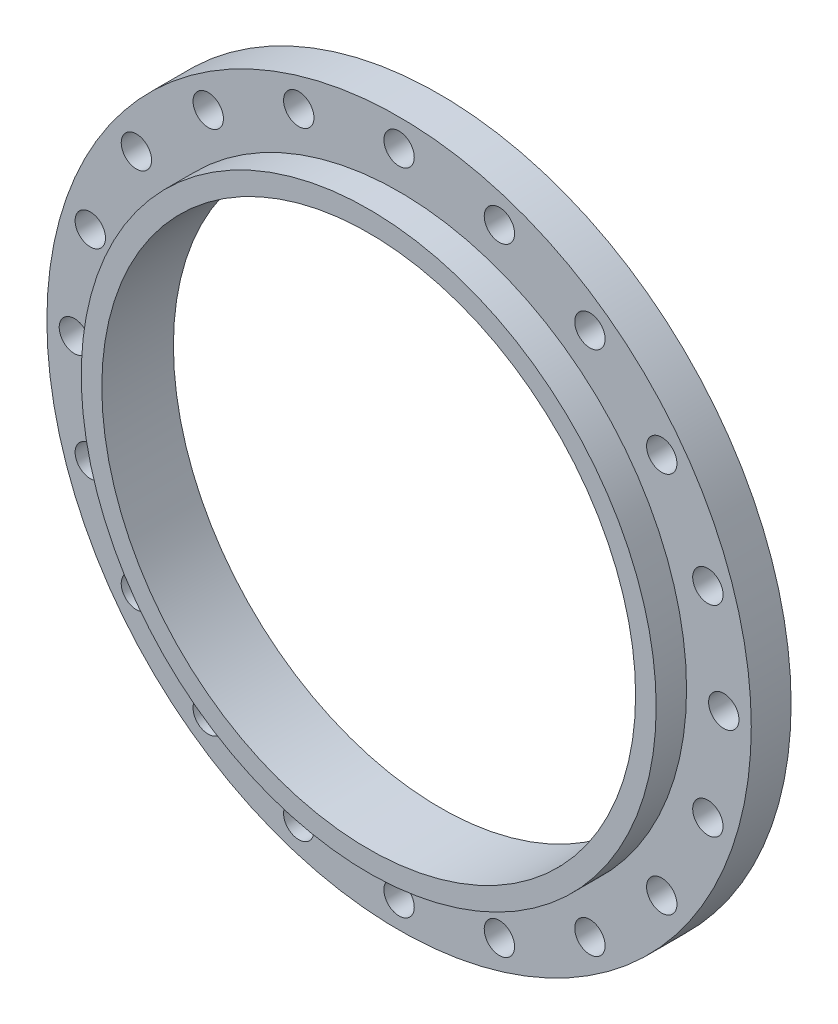
ISO-10303-21;
HEADER;
FILE_DESCRIPTION(('STEP AP214'),'2;1');
FILE_NAME('part.step','',(''),(''),'','','');
FILE_SCHEMA(('AUTOMOTIVE_DESIGN { 1 0 10303 214 1 1 1 1 }'));
ENDSEC;
DATA;
#1=APPLICATION_CONTEXT('core data for automotive mechanical design processes');
#2=APPLICATION_PROTOCOL_DEFINITION('international standard','automotive_design',2000,#1);
#3=PRODUCT_CONTEXT('',#1,'mechanical');
#4=PRODUCT('Part','Part','',(#3));
#5=PRODUCT_RELATED_PRODUCT_CATEGORY('part','',(#4));
#6=PRODUCT_DEFINITION_FORMATION('','',#4);
#7=PRODUCT_DEFINITION_CONTEXT('part definition',#1,'design');
#8=PRODUCT_DEFINITION('design','',#6,#7);
#9=PRODUCT_DEFINITION_SHAPE('','',#8);
#10=(LENGTH_UNIT() NAMED_UNIT(*) SI_UNIT(.MILLI.,.METRE.));
#11=(NAMED_UNIT(*) PLANE_ANGLE_UNIT() SI_UNIT($,.RADIAN.));
#12=(NAMED_UNIT(*) SI_UNIT($,.STERADIAN.) SOLID_ANGLE_UNIT());
#13=UNCERTAINTY_MEASURE_WITH_UNIT(LENGTH_MEASURE(1.E-05),#10,'distance_accuracy_value','');
#14=(GEOMETRIC_REPRESENTATION_CONTEXT(3) GLOBAL_UNCERTAINTY_ASSIGNED_CONTEXT((#13)) GLOBAL_UNIT_ASSIGNED_CONTEXT((#10,
#11,#12)) REPRESENTATION_CONTEXT('',''));
#15=CARTESIAN_POINT('',(0.,0.,0.));
#16=DIRECTION('',(0.,0.,1.));
#17=DIRECTION('',(1.,0.,0.));
#18=AXIS2_PLACEMENT_3D('',#15,#16,#17);
#19=CARTESIAN_POINT('',(0.,0.,18.2645913337541));
#20=DIRECTION('',(0.,0.,-1.));
#21=DIRECTION('',(-1.,0.,0.));
#22=AXIS2_PLACEMENT_3D('',#19,#20,#21);
#23=CYLINDRICAL_SURFACE('',#22,406.4);
#24=CARTESIAN_POINT('',(0.,0.,18.2645913337541));
#25=DIRECTION('',(0.,0.,1.));
#26=DIRECTION('',(1.,0.,0.));
#27=AXIS2_PLACEMENT_3D('',#24,#25,#26);
#28=CIRCLE('',#27,406.4);
#29=CARTESIAN_POINT('',(406.4,0.,18.2645913337541));
#30=VERTEX_POINT('',#29);
#31=EDGE_CURVE('E10',#30,#30,#28,.T.);
#32=ORIENTED_EDGE('',*,*,#31,.F.);
#33=EDGE_LOOP('',(#32));
#34=FACE_BOUND('',#33,.T.);
#35=CARTESIAN_POINT('',(0.,0.,-27.7094086662459));
#36=DIRECTION('',(0.,0.,1.));
#37=DIRECTION('',(1.,0.,0.));
#38=AXIS2_PLACEMENT_3D('',#35,#36,#37);
#39=CIRCLE('',#38,406.4);
#40=CARTESIAN_POINT('',(406.4,0.,-27.7094086662459));
#41=VERTEX_POINT('',#40);
#42=EDGE_CURVE('E41',#41,#41,#39,.T.);
#43=ORIENTED_EDGE('',*,*,#42,.T.);
#44=EDGE_LOOP('',(#43));
#45=FACE_BOUND('',#44,.T.);
#46=ADVANCED_FACE('F34',(#34,#45),#23,.T.);
#47=CARTESIAN_POINT('',(0.,0.,18.2645913337541));
#48=DIRECTION('',(0.,0.,1.));
#49=DIRECTION('',(1.,0.,0.));
#50=AXIS2_PLACEMENT_3D('',#47,#48,#49);
#51=PLANE('',#50);
#52=CARTESIAN_POINT('',(-220.213744771376,303.098216942574,18.2645913337541));
#53=DIRECTION('',(0.,0.,1.));
#54=DIRECTION('',(1.,0.,0.));
#55=AXIS2_PLACEMENT_3D('',#52,#53,#54);
#56=CIRCLE('',#55,17.526);
#57=CARTESIAN_POINT('',(-202.687744771376,303.098216942574,18.2645913337541));
#58=VERTEX_POINT('',#57);
#59=EDGE_CURVE('E68',#58,#58,#56,.F.);
#60=ORIENTED_EDGE('',*,*,#59,.T.);
#61=EDGE_LOOP('',(#60));
#62=FACE_BOUND('',#61,.T.);
#63=CARTESIAN_POINT('',(-303.098216942574,220.213744771374,18.2645913337541));
#64=DIRECTION('',(0.,0.,1.));
#65=DIRECTION('',(1.,0.,0.));
#66=AXIS2_PLACEMENT_3D('',#63,#64,#65);
#67=CIRCLE('',#66,17.526);
#68=CARTESIAN_POINT('',(-285.572216942575,220.213744771374,18.2645913337541));
#69=VERTEX_POINT('',#68);
#70=EDGE_CURVE('E71',#69,#69,#67,.F.);
#71=ORIENTED_EDGE('',*,*,#70,.T.);
#72=EDGE_LOOP('',(#71));
#73=FACE_BOUND('',#72,.T.);
#74=CARTESIAN_POINT('',(-356.31332382998,115.773216942573,18.2645913337541));
#75=DIRECTION('',(0.,0.,1.));
#76=DIRECTION('',(1.,0.,0.));
#77=AXIS2_PLACEMENT_3D('',#74,#75,#76);
#78=CIRCLE('',#77,17.526);
#79=CARTESIAN_POINT('',(-338.78732382998,115.773216942573,18.2645913337541));
#80=VERTEX_POINT('',#79);
#81=EDGE_CURVE('E74',#80,#80,#78,.F.);
#82=ORIENTED_EDGE('',*,*,#81,.T.);
#83=EDGE_LOOP('',(#82));
#84=FACE_BOUND('',#83,.T.);
#85=CARTESIAN_POINT('',(-374.65,-1.24643495181374E-12,18.2645913337541));
#86=DIRECTION('',(0.,0.,1.));
#87=DIRECTION('',(1.,0.,0.));
#88=AXIS2_PLACEMENT_3D('',#85,#86,#87);
#89=CIRCLE('',#88,17.526);
#90=CARTESIAN_POINT('',(-357.124,-1.24643495181374E-12,18.2645913337541));
#91=VERTEX_POINT('',#90);
#92=EDGE_CURVE('E77',#91,#91,#89,.F.);
#93=ORIENTED_EDGE('',*,*,#92,.T.);
#94=EDGE_LOOP('',(#93));
#95=FACE_BOUND('',#94,.T.);
#96=CARTESIAN_POINT('',(-356.313323829979,-115.773216942576,18.2645913337541));
#97=DIRECTION('',(0.,0.,1.));
#98=DIRECTION('',(1.,0.,0.));
#99=AXIS2_PLACEMENT_3D('',#96,#97,#98);
#100=CIRCLE('',#99,17.526);
#101=CARTESIAN_POINT('',(-338.787323829979,-115.773216942576,18.2645913337541));
#102=VERTEX_POINT('',#101);
#103=EDGE_CURVE('E80',#102,#102,#100,.F.);
#104=ORIENTED_EDGE('',*,*,#103,.T.);
#105=EDGE_LOOP('',(#104));
#106=FACE_BOUND('',#105,.T.);
#107=CARTESIAN_POINT('',(-303.098216942573,-220.213744771376,18.2645913337541));
#108=DIRECTION('',(0.,0.,1.));
#109=DIRECTION('',(1.,0.,0.));
#110=AXIS2_PLACEMENT_3D('',#107,#108,#109);
#111=CIRCLE('',#110,17.526);
#112=CARTESIAN_POINT('',(-285.572216942573,-220.213744771376,18.2645913337541));
#113=VERTEX_POINT('',#112);
#114=EDGE_CURVE('E83',#113,#113,#111,.F.);
#115=ORIENTED_EDGE('',*,*,#114,.T.);
#116=EDGE_LOOP('',(#115));
#117=FACE_BOUND('',#116,.T.);
#118=CARTESIAN_POINT('',(-220.213744771373,-303.098216942575,18.2645913337541));
#119=DIRECTION('',(0.,0.,1.));
#120=DIRECTION('',(1.,0.,0.));
#121=AXIS2_PLACEMENT_3D('',#118,#119,#120);
#122=CIRCLE('',#121,17.526);
#123=CARTESIAN_POINT('',(-202.687744771373,-303.098216942575,18.2645913337541));
#124=VERTEX_POINT('',#123);
#125=EDGE_CURVE('E86',#124,#124,#122,.F.);
#126=ORIENTED_EDGE('',*,*,#125,.T.);
#127=EDGE_LOOP('',(#126));
#128=FACE_BOUND('',#127,.T.);
#129=CARTESIAN_POINT('',(-115.773216942572,-356.31332382998,18.2645913337541));
#130=DIRECTION('',(0.,0.,1.));
#131=DIRECTION('',(1.,0.,0.));
#132=AXIS2_PLACEMENT_3D('',#129,#130,#131);
#133=CIRCLE('',#132,17.526);
#134=CARTESIAN_POINT('',(-98.2472169425717,-356.31332382998,18.2645913337541));
#135=VERTEX_POINT('',#134);
#136=EDGE_CURVE('E89',#135,#135,#133,.F.);
#137=ORIENTED_EDGE('',*,*,#136,.T.);
#138=EDGE_LOOP('',(#137));
#139=FACE_BOUND('',#138,.T.);
#140=CARTESIAN_POINT('',(0.,-374.65,18.2645913337541));
#141=DIRECTION('',(0.,0.,1.));
#142=DIRECTION('',(1.,0.,0.));
#143=AXIS2_PLACEMENT_3D('',#140,#141,#142);
#144=CIRCLE('',#143,17.526);
#145=CARTESIAN_POINT('',(17.526,-374.65,18.2645913337541));
#146=VERTEX_POINT('',#145);
#147=EDGE_CURVE('E92',#146,#146,#144,.F.);
#148=ORIENTED_EDGE('',*,*,#147,.T.);
#149=EDGE_LOOP('',(#148));
#150=FACE_BOUND('',#149,.T.);
#151=CARTESIAN_POINT('',(115.773216942577,-356.313323829978,18.2645913337541));
#152=DIRECTION('',(0.,0.,1.));
#153=DIRECTION('',(1.,0.,0.));
#154=AXIS2_PLACEMENT_3D('',#151,#152,#153);
#155=CIRCLE('',#154,17.526);
#156=CARTESIAN_POINT('',(133.299216942577,-356.313323829978,18.2645913337541));
#157=VERTEX_POINT('',#156);
#158=EDGE_CURVE('E95',#157,#157,#155,.F.);
#159=ORIENTED_EDGE('',*,*,#158,.T.);
#160=EDGE_LOOP('',(#159));
#161=FACE_BOUND('',#160,.T.);
#162=CARTESIAN_POINT('',(220.213744771378,-303.098216942572,18.2645913337541));
#163=DIRECTION('',(0.,0.,1.));
#164=DIRECTION('',(1.,0.,0.));
#165=AXIS2_PLACEMENT_3D('',#162,#163,#164);
#166=CIRCLE('',#165,17.526);
#167=CARTESIAN_POINT('',(237.739744771378,-303.098216942572,18.2645913337541));
#168=VERTEX_POINT('',#167);
#169=EDGE_CURVE('E98',#168,#168,#166,.F.);
#170=ORIENTED_EDGE('',*,*,#169,.T.);
#171=EDGE_LOOP('',(#170));
#172=FACE_BOUND('',#171,.T.);
#173=CARTESIAN_POINT('',(303.098216942576,-220.213744771372,18.2645913337541));
#174=DIRECTION('',(0.,0.,1.));
#175=DIRECTION('',(1.,0.,0.));
#176=AXIS2_PLACEMENT_3D('',#173,#174,#175);
#177=CIRCLE('',#176,17.526);
#178=CARTESIAN_POINT('',(320.624216942576,-220.213744771372,18.2645913337541));
#179=VERTEX_POINT('',#178);
#180=EDGE_CURVE('E101',#179,#179,#177,.F.);
#181=ORIENTED_EDGE('',*,*,#180,.T.);
#182=EDGE_LOOP('',(#181));
#183=FACE_BOUND('',#182,.T.);
#184=CARTESIAN_POINT('',(356.31332382998,-115.773216942571,18.2645913337541));
#185=DIRECTION('',(0.,0.,1.));
#186=DIRECTION('',(1.,0.,0.));
#187=AXIS2_PLACEMENT_3D('',#184,#185,#186);
#188=CIRCLE('',#187,17.526);
#189=CARTESIAN_POINT('',(373.83932382998,-115.773216942571,18.2645913337541));
#190=VERTEX_POINT('',#189);
#191=EDGE_CURVE('E104',#190,#190,#188,.F.);
#192=ORIENTED_EDGE('',*,*,#191,.T.);
#193=EDGE_LOOP('',(#192));
#194=FACE_BOUND('',#193,.T.);
#195=CARTESIAN_POINT('',(374.65,3.98589898257658E-12,18.2645913337541));
#196=DIRECTION('',(0.,0.,1.));
#197=DIRECTION('',(1.,0.,0.));
#198=AXIS2_PLACEMENT_3D('',#195,#196,#197);
#199=CIRCLE('',#198,17.526);
#200=CARTESIAN_POINT('',(392.176,3.98589898257658E-12,18.2645913337541));
#201=VERTEX_POINT('',#200);
#202=EDGE_CURVE('E107',#201,#201,#199,.F.);
#203=ORIENTED_EDGE('',*,*,#202,.T.);
#204=EDGE_LOOP('',(#203));
#205=FACE_BOUND('',#204,.T.);
#206=CARTESIAN_POINT('',(356.313323829978,115.773216942578,18.2645913337541));
#207=DIRECTION('',(0.,0.,1.));
#208=DIRECTION('',(1.,0.,0.));
#209=AXIS2_PLACEMENT_3D('',#206,#207,#208);
#210=CIRCLE('',#209,17.526);
#211=CARTESIAN_POINT('',(373.839323829978,115.773216942578,18.2645913337541));
#212=VERTEX_POINT('',#211);
#213=EDGE_CURVE('E110',#212,#212,#210,.F.);
#214=ORIENTED_EDGE('',*,*,#213,.T.);
#215=EDGE_LOOP('',(#214));
#216=FACE_BOUND('',#215,.T.);
#217=CARTESIAN_POINT('',(303.098216942571,220.213744771379,18.2645913337541));
#218=DIRECTION('',(0.,0.,1.));
#219=DIRECTION('',(1.,0.,0.));
#220=AXIS2_PLACEMENT_3D('',#217,#218,#219);
#221=CIRCLE('',#220,17.526);
#222=CARTESIAN_POINT('',(320.624216942571,220.213744771379,18.2645913337541));
#223=VERTEX_POINT('',#222);
#224=EDGE_CURVE('E113',#223,#223,#221,.F.);
#225=ORIENTED_EDGE('',*,*,#224,.T.);
#226=EDGE_LOOP('',(#225));
#227=FACE_BOUND('',#226,.T.);
#228=CARTESIAN_POINT('',(220.213744771371,303.098216942577,18.2645913337541));
#229=DIRECTION('',(0.,0.,1.));
#230=DIRECTION('',(1.,0.,0.));
#231=AXIS2_PLACEMENT_3D('',#228,#229,#230);
#232=CIRCLE('',#231,17.526);
#233=CARTESIAN_POINT('',(237.739744771371,303.098216942577,18.2645913337541));
#234=VERTEX_POINT('',#233);
#235=EDGE_CURVE('E116',#234,#234,#232,.F.);
#236=ORIENTED_EDGE('',*,*,#235,.T.);
#237=EDGE_LOOP('',(#236));
#238=FACE_BOUND('',#237,.T.);
#239=CARTESIAN_POINT('',(115.773216942569,356.313323829981,18.2645913337541));
#240=DIRECTION('',(0.,0.,1.));
#241=DIRECTION('',(1.,0.,0.));
#242=AXIS2_PLACEMENT_3D('',#239,#240,#241);
#243=CIRCLE('',#242,17.526);
#244=CARTESIAN_POINT('',(133.299216942569,356.313323829981,18.2645913337541));
#245=VERTEX_POINT('',#244);
#246=EDGE_CURVE('E119',#245,#245,#243,.F.);
#247=ORIENTED_EDGE('',*,*,#246,.T.);
#248=EDGE_LOOP('',(#247));
#249=FACE_BOUND('',#248,.T.);
#250=CARTESIAN_POINT('',(-115.773216942574,356.313323829979,18.2645913337541));
#251=DIRECTION('',(0.,0.,1.));
#252=DIRECTION('',(1.,0.,0.));
#253=AXIS2_PLACEMENT_3D('',#250,#251,#252);
#254=CIRCLE('',#253,17.526);
#255=CARTESIAN_POINT('',(-98.2472169425744,356.313323829979,18.2645913337541));
#256=VERTEX_POINT('',#255);
#257=EDGE_CURVE('E122',#256,#256,#254,.F.);
#258=ORIENTED_EDGE('',*,*,#257,.T.);
#259=EDGE_LOOP('',(#258));
#260=FACE_BOUND('',#259,.T.);
#261=CARTESIAN_POINT('',(0.,374.65,18.2645913337541));
#262=DIRECTION('',(0.,0.,1.));
#263=DIRECTION('',(1.,0.,0.));
#264=AXIS2_PLACEMENT_3D('',#261,#262,#263);
#265=CIRCLE('',#264,17.526);
#266=CARTESIAN_POINT('',(17.526,374.65,18.2645913337541));
#267=VERTEX_POINT('',#266);
#268=EDGE_CURVE('E62',#267,#267,#265,.F.);
#269=ORIENTED_EDGE('',*,*,#268,.T.);
#270=EDGE_LOOP('',(#269));
#271=FACE_BOUND('',#270,.T.);
#272=CARTESIAN_POINT('',(0.,0.,18.2645913337541));
#273=DIRECTION('',(0.,0.,1.));
#274=DIRECTION('',(1.,0.,0.));
#275=AXIS2_PLACEMENT_3D('',#272,#273,#274);
#276=CIRCLE('',#275,331.724);
#277=CARTESIAN_POINT('',(331.724,0.,18.2645913337541));
#278=VERTEX_POINT('',#277);
#279=EDGE_CURVE('E46',#278,#278,#276,.F.);
#280=ORIENTED_EDGE('',*,*,#279,.T.);
#281=EDGE_LOOP('',(#280));
#282=FACE_BOUND('',#281,.T.);
#283=ORIENTED_EDGE('',*,*,#31,.T.);
#284=EDGE_LOOP('',(#283));
#285=FACE_BOUND('',#284,.T.);
#286=ADVANCED_FACE('F204',(#62,#73,#84,#95,#106,#117,#128,#139,#150,#161,#172,#183,#194,#205,
#216,#227,#238,#249,#260,#271,#282,#285),#51,.T.);
#287=CARTESIAN_POINT('',(0.,0.,-27.7094086662459));
#288=DIRECTION('',(0.,0.,1.));
#289=DIRECTION('',(1.,0.,0.));
#290=AXIS2_PLACEMENT_3D('',#287,#288,#289);
#291=PLANE('',#290);
#292=CARTESIAN_POINT('',(-220.213744771376,303.098216942574,-27.7094086662459));
#293=DIRECTION('',(0.,0.,1.));
#294=DIRECTION('',(0.809016994374947,0.587785252292474,0.));
#295=AXIS2_PLACEMENT_3D('',#292,#293,#294);
#296=CIRCLE('',#295,17.526);
#297=CARTESIAN_POINT('',(-206.03491292796,313.399741274252,-27.7094086662459));
#298=VERTEX_POINT('',#297);
#299=EDGE_CURVE('E128',#298,#298,#296,.T.);
#300=ORIENTED_EDGE('',*,*,#299,.T.);
#301=EDGE_LOOP('',(#300));
#302=FACE_BOUND('',#301,.T.);
#303=CARTESIAN_POINT('',(-303.098216942574,220.213744771374,-27.7094086662459));
#304=DIRECTION('',(0.,0.,1.));
#305=DIRECTION('',(0.587785252292471,0.809016994374949,0.));
#306=AXIS2_PLACEMENT_3D('',#303,#304,#305);
#307=CIRCLE('',#306,17.526);
#308=CARTESIAN_POINT('',(-292.796692610897,234.39257661479,-27.7094086662459));
#309=VERTEX_POINT('',#308);
#310=EDGE_CURVE('E172',#309,#309,#307,.T.);
#311=ORIENTED_EDGE('',*,*,#310,.T.);
#312=EDGE_LOOP('',(#311));
#313=FACE_BOUND('',#312,.T.);
#314=CARTESIAN_POINT('',(-356.31332382998,115.773216942573,-27.7094086662459));
#315=DIRECTION('',(0.,0.,1.));
#316=DIRECTION('',(0.309016994374945,0.951056516295155,0.));
#317=AXIS2_PLACEMENT_3D('',#314,#315,#316);
#318=CIRCLE('',#317,17.526);
#319=CARTESIAN_POINT('',(-350.897491986564,132.441433447162,-27.7094086662459));
#320=VERTEX_POINT('',#319);
#321=EDGE_CURVE('E169',#320,#320,#318,.T.);
#322=ORIENTED_EDGE('',*,*,#321,.T.);
#323=EDGE_LOOP('',(#322));
#324=FACE_BOUND('',#323,.T.);
#325=CARTESIAN_POINT('',(-374.65,-1.24643495181374E-12,-27.7094086662459));
#326=DIRECTION('',(0.,0.,1.));
#327=DIRECTION('',(0.,1.,0.));
#328=AXIS2_PLACEMENT_3D('',#325,#326,#327);
#329=CIRCLE('',#328,17.526);
#330=CARTESIAN_POINT('',(-374.65,17.5259999999987,-27.7094086662459));
#331=VERTEX_POINT('',#330);
#332=EDGE_CURVE('E166',#331,#331,#329,.T.);
#333=ORIENTED_EDGE('',*,*,#332,.T.);
#334=EDGE_LOOP('',(#333));
#335=FACE_BOUND('',#334,.T.);
#336=CARTESIAN_POINT('',(-356.313323829979,-115.773216942576,-27.7094086662459));
#337=DIRECTION('',(0.,0.,1.));
#338=DIRECTION('',(-0.309016994374952,0.951056516295152,0.));
#339=AXIS2_PLACEMENT_3D('',#336,#337,#338);
#340=CIRCLE('',#339,17.526);
#341=CARTESIAN_POINT('',(-361.729155673394,-99.1050004379867,-27.7094086662459));
#342=VERTEX_POINT('',#341);
#343=EDGE_CURVE('E163',#342,#342,#340,.T.);
#344=ORIENTED_EDGE('',*,*,#343,.T.);
#345=EDGE_LOOP('',(#344));
#346=FACE_BOUND('',#345,.T.);
#347=CARTESIAN_POINT('',(-303.098216942573,-220.213744771376,-27.7094086662459));
#348=DIRECTION('',(0.,0.,1.));
#349=DIRECTION('',(-0.587785252292477,0.809016994374945,0.));
#350=AXIS2_PLACEMENT_3D('',#347,#348,#349);
#351=CIRCLE('',#350,17.526);
#352=CARTESIAN_POINT('',(-313.399741274251,-206.034912927961,-27.7094086662459));
#353=VERTEX_POINT('',#352);
#354=EDGE_CURVE('E160',#353,#353,#351,.T.);
#355=ORIENTED_EDGE('',*,*,#354,.T.);
#356=EDGE_LOOP('',(#355));
#357=FACE_BOUND('',#356,.T.);
#358=CARTESIAN_POINT('',(-220.213744771373,-303.098216942575,-27.7094086662459));
#359=DIRECTION('',(0.,0.,1.));
#360=DIRECTION('',(-0.809016994374951,0.587785252292469,0.));
#361=AXIS2_PLACEMENT_3D('',#358,#359,#360);
#362=CIRCLE('',#361,17.526);
#363=CARTESIAN_POINT('',(-234.392576614789,-292.796692610897,-27.7094086662459));
#364=VERTEX_POINT('',#363);
#365=EDGE_CURVE('E157',#364,#364,#362,.T.);
#366=ORIENTED_EDGE('',*,*,#365,.T.);
#367=EDGE_LOOP('',(#366));
#368=FACE_BOUND('',#367,.T.);
#369=CARTESIAN_POINT('',(-115.773216942572,-356.31332382998,-27.7094086662459));
#370=DIRECTION('',(0.,0.,1.));
#371=DIRECTION('',(-0.951056516295156,0.309016994374941,0.));
#372=AXIS2_PLACEMENT_3D('',#369,#370,#371);
#373=CIRCLE('',#372,17.526);
#374=CARTESIAN_POINT('',(-132.441433447161,-350.897491986565,-27.7094086662459));
#375=VERTEX_POINT('',#374);
#376=EDGE_CURVE('E154',#375,#375,#373,.T.);
#377=ORIENTED_EDGE('',*,*,#376,.T.);
#378=EDGE_LOOP('',(#377));
#379=FACE_BOUND('',#378,.T.);
#380=CARTESIAN_POINT('',(0.,-374.65,-27.7094086662459));
#381=DIRECTION('',(0.,0.,1.));
#382=DIRECTION('',(-1.,0.,0.));
#383=AXIS2_PLACEMENT_3D('',#380,#381,#382);
#384=CIRCLE('',#383,17.526);
#385=CARTESIAN_POINT('',(-17.526,-374.65,-27.7094086662459));
#386=VERTEX_POINT('',#385);
#387=EDGE_CURVE('E151',#386,#386,#384,.T.);
#388=ORIENTED_EDGE('',*,*,#387,.T.);
#389=EDGE_LOOP('',(#388));
#390=FACE_BOUND('',#389,.T.);
#391=CARTESIAN_POINT('',(115.773216942577,-356.313323829978,-27.7094086662459));
#392=DIRECTION('',(0.,0.,1.));
#393=DIRECTION('',(-0.951056516295151,-0.309016994374955,0.));
#394=AXIS2_PLACEMENT_3D('',#391,#392,#393);
#395=CIRCLE('',#394,17.526);
#396=CARTESIAN_POINT('',(99.105000437988,-361.729155673394,-27.7094086662459));
#397=VERTEX_POINT('',#396);
#398=EDGE_CURVE('E148',#397,#397,#395,.T.);
#399=ORIENTED_EDGE('',*,*,#398,.T.);
#400=EDGE_LOOP('',(#399));
#401=FACE_BOUND('',#400,.T.);
#402=CARTESIAN_POINT('',(220.213744771378,-303.098216942572,-27.7094086662459));
#403=DIRECTION('',(0.,0.,1.));
#404=DIRECTION('',(-0.809016994374942,-0.58778525229248,0.));
#405=AXIS2_PLACEMENT_3D('',#402,#403,#404);
#406=CIRCLE('',#405,17.526);
#407=CARTESIAN_POINT('',(206.034912927962,-313.39974127425,-27.7094086662459));
#408=VERTEX_POINT('',#407);
#409=EDGE_CURVE('E145',#408,#408,#406,.T.);
#410=ORIENTED_EDGE('',*,*,#409,.T.);
#411=EDGE_LOOP('',(#410));
#412=FACE_BOUND('',#411,.T.);
#413=CARTESIAN_POINT('',(303.098216942576,-220.213744771372,-27.7094086662459));
#414=DIRECTION('',(0.,0.,1.));
#415=DIRECTION('',(-0.587785252292465,-0.809016994374953,0.));
#416=AXIS2_PLACEMENT_3D('',#413,#414,#415);
#417=CIRCLE('',#416,17.526);
#418=CARTESIAN_POINT('',(292.796692610898,-234.392576614787,-27.7094086662459));
#419=VERTEX_POINT('',#418);
#420=EDGE_CURVE('E142',#419,#419,#417,.T.);
#421=ORIENTED_EDGE('',*,*,#420,.T.);
#422=EDGE_LOOP('',(#421));
#423=FACE_BOUND('',#422,.T.);
#424=CARTESIAN_POINT('',(356.31332382998,-115.773216942571,-27.7094086662459));
#425=DIRECTION('',(0.,0.,1.));
#426=DIRECTION('',(-0.309016994374938,-0.951056516295157,0.));
#427=AXIS2_PLACEMENT_3D('',#424,#425,#426);
#428=CIRCLE('',#427,17.526);
#429=CARTESIAN_POINT('',(350.897491986565,-132.441433447159,-27.7094086662459));
#430=VERTEX_POINT('',#429);
#431=EDGE_CURVE('E139',#430,#430,#428,.T.);
#432=ORIENTED_EDGE('',*,*,#431,.T.);
#433=EDGE_LOOP('',(#432));
#434=FACE_BOUND('',#433,.T.);
#435=CARTESIAN_POINT('',(374.65,3.98589898257658E-12,-27.7094086662459));
#436=DIRECTION('',(0.,0.,1.));
#437=DIRECTION('',(0.,-1.,0.));
#438=AXIS2_PLACEMENT_3D('',#435,#436,#437);
#439=CIRCLE('',#438,17.526);
#440=CARTESIAN_POINT('',(374.65,-17.525999999996,-27.7094086662459));
#441=VERTEX_POINT('',#440);
#442=EDGE_CURVE('E136',#441,#441,#439,.T.);
#443=ORIENTED_EDGE('',*,*,#442,.T.);
#444=EDGE_LOOP('',(#443));
#445=FACE_BOUND('',#444,.T.);
#446=CARTESIAN_POINT('',(356.313323829978,115.773216942578,-27.7094086662459));
#447=DIRECTION('',(0.,0.,1.));
#448=DIRECTION('',(0.309016994374958,-0.95105651629515,0.));
#449=AXIS2_PLACEMENT_3D('',#446,#447,#448);
#450=CIRCLE('',#449,17.526);
#451=CARTESIAN_POINT('',(361.729155673393,99.1050004379894,-27.7094086662459));
#452=VERTEX_POINT('',#451);
#453=EDGE_CURVE('E132',#452,#452,#450,.T.);
#454=ORIENTED_EDGE('',*,*,#453,.T.);
#455=EDGE_LOOP('',(#454));
#456=FACE_BOUND('',#455,.T.);
#457=CARTESIAN_POINT('',(303.098216942571,220.213744771379,-27.7094086662459));
#458=DIRECTION('',(0.,0.,1.));
#459=DIRECTION('',(0.587785252292483,-0.80901699437494,0.));
#460=AXIS2_PLACEMENT_3D('',#457,#458,#459);
#461=CIRCLE('',#460,17.526);
#462=CARTESIAN_POINT('',(313.399741274249,206.034912927964,-27.7094086662459));
#463=VERTEX_POINT('',#462);
#464=EDGE_CURVE('E129',#463,#463,#461,.T.);
#465=ORIENTED_EDGE('',*,*,#464,.T.);
#466=EDGE_LOOP('',(#465));
#467=FACE_BOUND('',#466,.T.);
#468=CARTESIAN_POINT('',(220.213744771371,303.098216942577,-27.7094086662459));
#469=DIRECTION('',(0.,0.,1.));
#470=DIRECTION('',(0.809016994374955,-0.587785252292462,0.));
#471=AXIS2_PLACEMENT_3D('',#468,#469,#470);
#472=CIRCLE('',#471,17.526);
#473=CARTESIAN_POINT('',(234.392576614787,292.796692610899,-27.7094086662459));
#474=VERTEX_POINT('',#473);
#475=EDGE_CURVE('E133',#474,#474,#472,.T.);
#476=ORIENTED_EDGE('',*,*,#475,.T.);
#477=EDGE_LOOP('',(#476));
#478=FACE_BOUND('',#477,.T.);
#479=CARTESIAN_POINT('',(115.773216942569,356.313323829981,-27.7094086662459));
#480=DIRECTION('',(0.,0.,1.));
#481=DIRECTION('',(0.951056516295158,-0.309016994374935,0.));
#482=AXIS2_PLACEMENT_3D('',#479,#480,#481);
#483=CIRCLE('',#482,17.526);
#484=CARTESIAN_POINT('',(132.441433447158,350.897491986566,-27.7094086662459));
#485=VERTEX_POINT('',#484);
#486=EDGE_CURVE('E177',#485,#485,#483,.T.);
#487=ORIENTED_EDGE('',*,*,#486,.T.);
#488=EDGE_LOOP('',(#487));
#489=FACE_BOUND('',#488,.T.);
#490=CARTESIAN_POINT('',(-115.773216942574,356.313323829979,-27.7094086662459));
#491=DIRECTION('',(0.,0.,1.));
#492=DIRECTION('',(0.951056516295154,0.309016994374948,0.));
#493=AXIS2_PLACEMENT_3D('',#490,#491,#492);
#494=CIRCLE('',#493,17.526);
#495=CARTESIAN_POINT('',(-99.1050004379855,361.729155673395,-27.7094086662459));
#496=VERTEX_POINT('',#495);
#497=EDGE_CURVE('E125',#496,#496,#494,.T.);
#498=ORIENTED_EDGE('',*,*,#497,.T.);
#499=EDGE_LOOP('',(#498));
#500=FACE_BOUND('',#499,.T.);
#501=CARTESIAN_POINT('',(0.,374.65,-27.7094086662459));
#502=DIRECTION('',(0.,0.,1.));
#503=DIRECTION('',(1.,0.,0.));
#504=AXIS2_PLACEMENT_3D('',#501,#502,#503);
#505=CIRCLE('',#504,17.526);
#506=CARTESIAN_POINT('',(17.526,374.65,-27.7094086662459));
#507=VERTEX_POINT('',#506);
#508=EDGE_CURVE('E65',#507,#507,#505,.T.);
#509=ORIENTED_EDGE('',*,*,#508,.T.);
#510=EDGE_LOOP('',(#509));
#511=FACE_BOUND('',#510,.T.);
#512=CARTESIAN_POINT('',(0.,0.,-27.7094086662459));
#513=DIRECTION('',(0.,0.,1.));
#514=DIRECTION('',(1.,0.,0.));
#515=AXIS2_PLACEMENT_3D('',#512,#513,#514);
#516=CIRCLE('',#515,346.075);
#517=CARTESIAN_POINT('',(346.075,0.,-27.7094086662459));
#518=VERTEX_POINT('',#517);
#519=EDGE_CURVE('E54',#518,#518,#516,.T.);
#520=ORIENTED_EDGE('',*,*,#519,.T.);
#521=EDGE_LOOP('',(#520));
#522=FACE_BOUND('',#521,.T.);
#523=ORIENTED_EDGE('',*,*,#42,.F.);
#524=EDGE_LOOP('',(#523));
#525=FACE_BOUND('',#524,.T.);
#526=ADVANCED_FACE('F183',(#302,#313,#324,#335,#346,#357,#368,#379,#390,#401,#412,#423,#434,
#445,#456,#467,#478,#489,#500,#511,#522,#525),#291,.F.);
#527=CARTESIAN_POINT('',(0.,0.,53.3165913337541));
#528=DIRECTION('',(0.,0.,-1.));
#529=DIRECTION('',(-1.,0.,0.));
#530=AXIS2_PLACEMENT_3D('',#527,#528,#529);
#531=CYLINDRICAL_SURFACE('',#530,331.724);
#532=ORIENTED_EDGE('',*,*,#279,.F.);
#533=EDGE_LOOP('',(#532));
#534=FACE_BOUND('',#533,.T.);
#535=CARTESIAN_POINT('',(0.,0.,53.3165913337541));
#536=DIRECTION('',(0.,0.,1.));
#537=DIRECTION('',(1.,0.,0.));
#538=AXIS2_PLACEMENT_3D('',#535,#536,#537);
#539=CIRCLE('',#538,331.724);
#540=CARTESIAN_POINT('',(331.724,0.,53.3165913337541));
#541=VERTEX_POINT('',#540);
#542=EDGE_CURVE('E50',#541,#541,#539,.T.);
#543=ORIENTED_EDGE('',*,*,#542,.F.);
#544=EDGE_LOOP('',(#543));
#545=FACE_BOUND('',#544,.T.);
#546=ADVANCED_FACE('F215',(#534,#545),#531,.T.);
#547=CARTESIAN_POINT('',(0.,0.,53.3165913337541));
#548=DIRECTION('',(0.,0.,1.));
#549=DIRECTION('',(1.,0.,0.));
#550=AXIS2_PLACEMENT_3D('',#547,#548,#549);
#551=PLANE('',#550);
#552=CARTESIAN_POINT('',(0.,0.,53.3165913337541));
#553=DIRECTION('',(0.,0.,1.));
#554=DIRECTION('',(1.,0.,0.));
#555=AXIS2_PLACEMENT_3D('',#552,#553,#554);
#556=CIRCLE('',#555,307.975);
#557=CARTESIAN_POINT('',(307.975,0.,53.3165913337541));
#558=VERTEX_POINT('',#557);
#559=EDGE_CURVE('E57',#558,#558,#556,.F.);
#560=ORIENTED_EDGE('',*,*,#559,.T.);
#561=EDGE_LOOP('',(#560));
#562=FACE_BOUND('',#561,.T.);
#563=ORIENTED_EDGE('',*,*,#542,.T.);
#564=EDGE_LOOP('',(#563));
#565=FACE_BOUND('',#564,.T.);
#566=ADVANCED_FACE('F220',(#562,#565),#551,.T.);
#567=CARTESIAN_POINT('',(0.,0.,-29.2969086662459));
#568=DIRECTION('',(0.,0.,1.));
#569=DIRECTION('',(1.,0.,0.));
#570=AXIS2_PLACEMENT_3D('',#567,#568,#569);
#571=CYLINDRICAL_SURFACE('',#570,346.075);
#572=CARTESIAN_POINT('',(0.,0.,-29.2969086662459));
#573=DIRECTION('',(0.,0.,1.));
#574=DIRECTION('',(1.,0.,0.));
#575=AXIS2_PLACEMENT_3D('',#572,#573,#574);
#576=CIRCLE('',#575,346.075);
#577=CARTESIAN_POINT('',(346.075,0.,-29.2969086662459));
#578=VERTEX_POINT('',#577);
#579=EDGE_CURVE('E53',#578,#578,#576,.T.);
#580=ORIENTED_EDGE('',*,*,#579,.T.);
#581=EDGE_LOOP('',(#580));
#582=FACE_BOUND('',#581,.T.);
#583=ORIENTED_EDGE('',*,*,#519,.F.);
#584=EDGE_LOOP('',(#583));
#585=FACE_BOUND('',#584,.T.);
#586=ADVANCED_FACE('F227',(#582,#585),#571,.T.);
#587=CARTESIAN_POINT('',(0.,0.,-29.2969086662459));
#588=DIRECTION('',(0.,0.,1.));
#589=DIRECTION('',(1.,0.,0.));
#590=AXIS2_PLACEMENT_3D('',#587,#588,#589);
#591=PLANE('',#590);
#592=CARTESIAN_POINT('',(0.,0.,-29.2969086662459));
#593=DIRECTION('',(0.,0.,1.));
#594=DIRECTION('',(1.,0.,0.));
#595=AXIS2_PLACEMENT_3D('',#592,#593,#594);
#596=CIRCLE('',#595,307.975);
#597=CARTESIAN_POINT('',(307.975,0.,-29.2969086662459));
#598=VERTEX_POINT('',#597);
#599=EDGE_CURVE('E37',#598,#598,#596,.F.);
#600=ORIENTED_EDGE('',*,*,#599,.F.);
#601=EDGE_LOOP('',(#600));
#602=FACE_BOUND('',#601,.T.);
#603=ORIENTED_EDGE('',*,*,#579,.F.);
#604=EDGE_LOOP('',(#603));
#605=FACE_BOUND('',#604,.T.);
#606=ADVANCED_FACE('F231',(#602,#605),#591,.F.);
#607=CARTESIAN_POINT('',(0.,0.,1394.69059133375));
#608=DIRECTION('',(0.,0.,-1.));
#609=DIRECTION('',(-1.,0.,0.));
#610=AXIS2_PLACEMENT_3D('',#607,#608,#609);
#611=CYLINDRICAL_SURFACE('',#610,307.975);
#612=ORIENTED_EDGE('',*,*,#559,.F.);
#613=EDGE_LOOP('',(#612));
#614=FACE_BOUND('',#613,.T.);
#615=ORIENTED_EDGE('',*,*,#599,.T.);
#616=EDGE_LOOP('',(#615));
#617=FACE_BOUND('',#616,.T.);
#618=ADVANCED_FACE('F235',(#614,#617),#611,.F.);
#619=CARTESIAN_POINT('',(0.,374.65,24.6780913337541));
#620=DIRECTION('',(0.,0.,-1.));
#621=DIRECTION('',(-1.,0.,0.));
#622=AXIS2_PLACEMENT_3D('',#619,#620,#621);
#623=CYLINDRICAL_SURFACE('',#622,17.526);
#624=ORIENTED_EDGE('',*,*,#268,.F.);
#625=EDGE_LOOP('',(#624));
#626=FACE_BOUND('',#625,.T.);
#627=ORIENTED_EDGE('',*,*,#508,.F.);
#628=EDGE_LOOP('',(#627));
#629=FACE_BOUND('',#628,.T.);
#630=ADVANCED_FACE('F239',(#626,#629),#623,.F.);
#631=CARTESIAN_POINT('',(-115.773216942574,356.313323829979,24.6780913337541));
#632=DIRECTION('',(0.,0.,-1.));
#633=DIRECTION('',(-1.,0.,0.));
#634=AXIS2_PLACEMENT_3D('',#631,#632,#633);
#635=CYLINDRICAL_SURFACE('',#634,17.526);
#636=ORIENTED_EDGE('',*,*,#257,.F.);
#637=EDGE_LOOP('',(#636));
#638=FACE_BOUND('',#637,.T.);
#639=ORIENTED_EDGE('',*,*,#497,.F.);
#640=EDGE_LOOP('',(#639));
#641=FACE_BOUND('',#640,.T.);
#642=ADVANCED_FACE('F199',(#638,#641),#635,.F.);
#643=CARTESIAN_POINT('',(115.773216942569,356.313323829981,24.6780913337541));
#644=DIRECTION('',(0.,0.,-1.));
#645=DIRECTION('',(-1.,0.,0.));
#646=AXIS2_PLACEMENT_3D('',#643,#644,#645);
#647=CYLINDRICAL_SURFACE('',#646,17.526);
#648=ORIENTED_EDGE('',*,*,#246,.F.);
#649=EDGE_LOOP('',(#648));
#650=FACE_BOUND('',#649,.T.);
#651=ORIENTED_EDGE('',*,*,#486,.F.);
#652=EDGE_LOOP('',(#651));
#653=FACE_BOUND('',#652,.T.);
#654=ADVANCED_FACE('F189',(#650,#653),#647,.F.);
#655=CARTESIAN_POINT('',(220.213744771371,303.098216942577,24.6780913337541));
#656=DIRECTION('',(0.,0.,-1.));
#657=DIRECTION('',(-1.,0.,0.));
#658=AXIS2_PLACEMENT_3D('',#655,#656,#657);
#659=CYLINDRICAL_SURFACE('',#658,17.526);
#660=ORIENTED_EDGE('',*,*,#235,.F.);
#661=EDGE_LOOP('',(#660));
#662=FACE_BOUND('',#661,.T.);
#663=ORIENTED_EDGE('',*,*,#475,.F.);
#664=EDGE_LOOP('',(#663));
#665=FACE_BOUND('',#664,.T.);
#666=ADVANCED_FACE('F186',(#662,#665),#659,.F.);
#667=CARTESIAN_POINT('',(303.098216942571,220.213744771379,24.6780913337541));
#668=DIRECTION('',(0.,0.,-1.));
#669=DIRECTION('',(-1.,0.,0.));
#670=AXIS2_PLACEMENT_3D('',#667,#668,#669);
#671=CYLINDRICAL_SURFACE('',#670,17.526);
#672=ORIENTED_EDGE('',*,*,#224,.F.);
#673=EDGE_LOOP('',(#672));
#674=FACE_BOUND('',#673,.T.);
#675=ORIENTED_EDGE('',*,*,#464,.F.);
#676=EDGE_LOOP('',(#675));
#677=FACE_BOUND('',#676,.T.);
#678=ADVANCED_FACE('F188',(#674,#677),#671,.F.);
#679=CARTESIAN_POINT('',(356.313323829978,115.773216942578,24.6780913337541));
#680=DIRECTION('',(0.,0.,-1.));
#681=DIRECTION('',(-1.,0.,0.));
#682=AXIS2_PLACEMENT_3D('',#679,#680,#681);
#683=CYLINDRICAL_SURFACE('',#682,17.526);
#684=ORIENTED_EDGE('',*,*,#213,.F.);
#685=EDGE_LOOP('',(#684));
#686=FACE_BOUND('',#685,.T.);
#687=ORIENTED_EDGE('',*,*,#453,.F.);
#688=EDGE_LOOP('',(#687));
#689=FACE_BOUND('',#688,.T.);
#690=ADVANCED_FACE('F196',(#686,#689),#683,.F.);
#691=CARTESIAN_POINT('',(374.65,3.98589898257658E-12,24.6780913337541));
#692=DIRECTION('',(0.,0.,-1.));
#693=DIRECTION('',(-1.,0.,0.));
#694=AXIS2_PLACEMENT_3D('',#691,#692,#693);
#695=CYLINDRICAL_SURFACE('',#694,17.526);
#696=ORIENTED_EDGE('',*,*,#202,.F.);
#697=EDGE_LOOP('',(#696));
#698=FACE_BOUND('',#697,.T.);
#699=ORIENTED_EDGE('',*,*,#442,.F.);
#700=EDGE_LOOP('',(#699));
#701=FACE_BOUND('',#700,.T.);
#702=ADVANCED_FACE('F249',(#698,#701),#695,.F.);
#703=CARTESIAN_POINT('',(356.31332382998,-115.773216942571,24.6780913337541));
#704=DIRECTION('',(0.,0.,-1.));
#705=DIRECTION('',(-1.,0.,0.));
#706=AXIS2_PLACEMENT_3D('',#703,#704,#705);
#707=CYLINDRICAL_SURFACE('',#706,17.526);
#708=ORIENTED_EDGE('',*,*,#191,.F.);
#709=EDGE_LOOP('',(#708));
#710=FACE_BOUND('',#709,.T.);
#711=ORIENTED_EDGE('',*,*,#431,.F.);
#712=EDGE_LOOP('',(#711));
#713=FACE_BOUND('',#712,.T.);
#714=ADVANCED_FACE('F253',(#710,#713),#707,.F.);
#715=CARTESIAN_POINT('',(303.098216942576,-220.213744771372,24.6780913337541));
#716=DIRECTION('',(0.,0.,-1.));
#717=DIRECTION('',(-1.,0.,0.));
#718=AXIS2_PLACEMENT_3D('',#715,#716,#717);
#719=CYLINDRICAL_SURFACE('',#718,17.526);
#720=ORIENTED_EDGE('',*,*,#180,.F.);
#721=EDGE_LOOP('',(#720));
#722=FACE_BOUND('',#721,.T.);
#723=ORIENTED_EDGE('',*,*,#420,.F.);
#724=EDGE_LOOP('',(#723));
#725=FACE_BOUND('',#724,.T.);
#726=ADVANCED_FACE('F257',(#722,#725),#719,.F.);
#727=CARTESIAN_POINT('',(220.213744771378,-303.098216942572,24.6780913337541));
#728=DIRECTION('',(0.,0.,-1.));
#729=DIRECTION('',(-1.,0.,0.));
#730=AXIS2_PLACEMENT_3D('',#727,#728,#729);
#731=CYLINDRICAL_SURFACE('',#730,17.526);
#732=ORIENTED_EDGE('',*,*,#169,.F.);
#733=EDGE_LOOP('',(#732));
#734=FACE_BOUND('',#733,.T.);
#735=ORIENTED_EDGE('',*,*,#409,.F.);
#736=EDGE_LOOP('',(#735));
#737=FACE_BOUND('',#736,.T.);
#738=ADVANCED_FACE('F261',(#734,#737),#731,.F.);
#739=CARTESIAN_POINT('',(115.773216942577,-356.313323829978,24.6780913337541));
#740=DIRECTION('',(0.,0.,-1.));
#741=DIRECTION('',(-1.,0.,0.));
#742=AXIS2_PLACEMENT_3D('',#739,#740,#741);
#743=CYLINDRICAL_SURFACE('',#742,17.526);
#744=ORIENTED_EDGE('',*,*,#158,.F.);
#745=EDGE_LOOP('',(#744));
#746=FACE_BOUND('',#745,.T.);
#747=ORIENTED_EDGE('',*,*,#398,.F.);
#748=EDGE_LOOP('',(#747));
#749=FACE_BOUND('',#748,.T.);
#750=ADVANCED_FACE('F265',(#746,#749),#743,.F.);
#751=CARTESIAN_POINT('',(0.,-374.65,24.6780913337541));
#752=DIRECTION('',(0.,0.,-1.));
#753=DIRECTION('',(-1.,0.,0.));
#754=AXIS2_PLACEMENT_3D('',#751,#752,#753);
#755=CYLINDRICAL_SURFACE('',#754,17.526);
#756=ORIENTED_EDGE('',*,*,#147,.F.);
#757=EDGE_LOOP('',(#756));
#758=FACE_BOUND('',#757,.T.);
#759=ORIENTED_EDGE('',*,*,#387,.F.);
#760=EDGE_LOOP('',(#759));
#761=FACE_BOUND('',#760,.T.);
#762=ADVANCED_FACE('F269',(#758,#761),#755,.F.);
#763=CARTESIAN_POINT('',(-115.773216942572,-356.31332382998,24.6780913337541));
#764=DIRECTION('',(0.,0.,-1.));
#765=DIRECTION('',(-1.,0.,0.));
#766=AXIS2_PLACEMENT_3D('',#763,#764,#765);
#767=CYLINDRICAL_SURFACE('',#766,17.526);
#768=ORIENTED_EDGE('',*,*,#136,.F.);
#769=EDGE_LOOP('',(#768));
#770=FACE_BOUND('',#769,.T.);
#771=ORIENTED_EDGE('',*,*,#376,.F.);
#772=EDGE_LOOP('',(#771));
#773=FACE_BOUND('',#772,.T.);
#774=ADVANCED_FACE('F273',(#770,#773),#767,.F.);
#775=CARTESIAN_POINT('',(-220.213744771373,-303.098216942575,24.6780913337541));
#776=DIRECTION('',(0.,0.,-1.));
#777=DIRECTION('',(-1.,0.,0.));
#778=AXIS2_PLACEMENT_3D('',#775,#776,#777);
#779=CYLINDRICAL_SURFACE('',#778,17.526);
#780=ORIENTED_EDGE('',*,*,#125,.F.);
#781=EDGE_LOOP('',(#780));
#782=FACE_BOUND('',#781,.T.);
#783=ORIENTED_EDGE('',*,*,#365,.F.);
#784=EDGE_LOOP('',(#783));
#785=FACE_BOUND('',#784,.T.);
#786=ADVANCED_FACE('F277',(#782,#785),#779,.F.);
#787=CARTESIAN_POINT('',(-303.098216942573,-220.213744771376,24.6780913337541));
#788=DIRECTION('',(0.,0.,-1.));
#789=DIRECTION('',(-1.,0.,0.));
#790=AXIS2_PLACEMENT_3D('',#787,#788,#789);
#791=CYLINDRICAL_SURFACE('',#790,17.526);
#792=ORIENTED_EDGE('',*,*,#114,.F.);
#793=EDGE_LOOP('',(#792));
#794=FACE_BOUND('',#793,.T.);
#795=ORIENTED_EDGE('',*,*,#354,.F.);
#796=EDGE_LOOP('',(#795));
#797=FACE_BOUND('',#796,.T.);
#798=ADVANCED_FACE('F281',(#794,#797),#791,.F.);
#799=CARTESIAN_POINT('',(-356.313323829979,-115.773216942576,24.6780913337541));
#800=DIRECTION('',(0.,0.,-1.));
#801=DIRECTION('',(-1.,0.,0.));
#802=AXIS2_PLACEMENT_3D('',#799,#800,#801);
#803=CYLINDRICAL_SURFACE('',#802,17.526);
#804=ORIENTED_EDGE('',*,*,#103,.F.);
#805=EDGE_LOOP('',(#804));
#806=FACE_BOUND('',#805,.T.);
#807=ORIENTED_EDGE('',*,*,#343,.F.);
#808=EDGE_LOOP('',(#807));
#809=FACE_BOUND('',#808,.T.);
#810=ADVANCED_FACE('F285',(#806,#809),#803,.F.);
#811=CARTESIAN_POINT('',(-374.65,-1.24643495181374E-12,24.6780913337541));
#812=DIRECTION('',(0.,0.,-1.));
#813=DIRECTION('',(-1.,0.,0.));
#814=AXIS2_PLACEMENT_3D('',#811,#812,#813);
#815=CYLINDRICAL_SURFACE('',#814,17.526);
#816=ORIENTED_EDGE('',*,*,#92,.F.);
#817=EDGE_LOOP('',(#816));
#818=FACE_BOUND('',#817,.T.);
#819=ORIENTED_EDGE('',*,*,#332,.F.);
#820=EDGE_LOOP('',(#819));
#821=FACE_BOUND('',#820,.T.);
#822=ADVANCED_FACE('F289',(#818,#821),#815,.F.);
#823=CARTESIAN_POINT('',(-356.31332382998,115.773216942573,24.6780913337541));
#824=DIRECTION('',(0.,0.,-1.));
#825=DIRECTION('',(-1.,0.,0.));
#826=AXIS2_PLACEMENT_3D('',#823,#824,#825);
#827=CYLINDRICAL_SURFACE('',#826,17.526);
#828=ORIENTED_EDGE('',*,*,#81,.F.);
#829=EDGE_LOOP('',(#828));
#830=FACE_BOUND('',#829,.T.);
#831=ORIENTED_EDGE('',*,*,#321,.F.);
#832=EDGE_LOOP('',(#831));
#833=FACE_BOUND('',#832,.T.);
#834=ADVANCED_FACE('F293',(#830,#833),#827,.F.);
#835=CARTESIAN_POINT('',(-303.098216942574,220.213744771374,24.6780913337541));
#836=DIRECTION('',(0.,0.,-1.));
#837=DIRECTION('',(-1.,0.,0.));
#838=AXIS2_PLACEMENT_3D('',#835,#836,#837);
#839=CYLINDRICAL_SURFACE('',#838,17.526);
#840=ORIENTED_EDGE('',*,*,#70,.F.);
#841=EDGE_LOOP('',(#840));
#842=FACE_BOUND('',#841,.T.);
#843=ORIENTED_EDGE('',*,*,#310,.F.);
#844=EDGE_LOOP('',(#843));
#845=FACE_BOUND('',#844,.T.);
#846=ADVANCED_FACE('F297',(#842,#845),#839,.F.);
#847=CARTESIAN_POINT('',(-220.213744771376,303.098216942574,24.6780913337541));
#848=DIRECTION('',(0.,0.,-1.));
#849=DIRECTION('',(-1.,0.,0.));
#850=AXIS2_PLACEMENT_3D('',#847,#848,#849);
#851=CYLINDRICAL_SURFACE('',#850,17.526);
#852=ORIENTED_EDGE('',*,*,#59,.F.);
#853=EDGE_LOOP('',(#852));
#854=FACE_BOUND('',#853,.T.);
#855=ORIENTED_EDGE('',*,*,#299,.F.);
#856=EDGE_LOOP('',(#855));
#857=FACE_BOUND('',#856,.T.);
#858=ADVANCED_FACE('F301',(#854,#857),#851,.F.);
#859=CLOSED_SHELL('',(#46,#286,#526,#546,#566,#586,#606,#618,#630,#642,#654,#666,#678,#690,#702,
#714,#726,#738,#750,#762,#774,#786,#798,#810,#822,#834,#846,#858));
#860=MANIFOLD_SOLID_BREP('B2',#859);
#861=ADVANCED_BREP_SHAPE_REPRESENTATION('',(#18,#860),#14);
#862=SHAPE_DEFINITION_REPRESENTATION(#9,#861);
ENDSEC;
END-ISO-10303-21;
